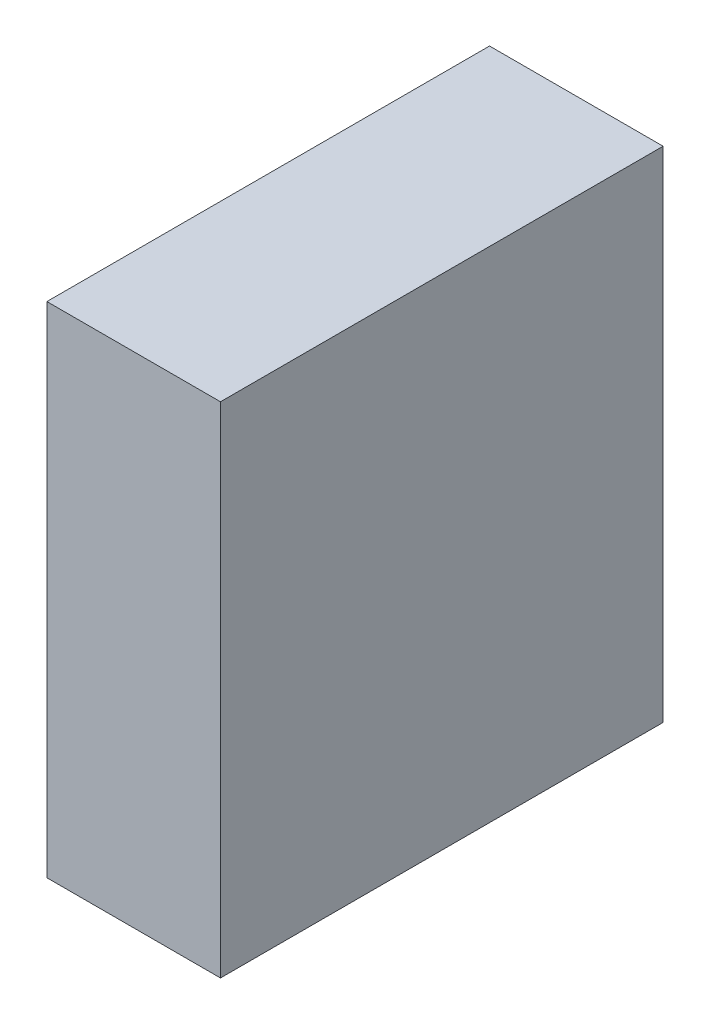
ISO-10303-21;
HEADER;
FILE_DESCRIPTION(('STEP AP214'),'2;1');
FILE_NAME('part.step','',(''),(''),'','','');
FILE_SCHEMA(('AUTOMOTIVE_DESIGN { 1 0 10303 214 1 1 1 1 }'));
ENDSEC;
DATA;
#1=APPLICATION_CONTEXT('core data for automotive mechanical design processes');
#2=APPLICATION_PROTOCOL_DEFINITION('international standard','automotive_design',2000,#1);
#3=PRODUCT_CONTEXT('',#1,'mechanical');
#4=PRODUCT('Part','Part','',(#3));
#5=PRODUCT_RELATED_PRODUCT_CATEGORY('part','',(#4));
#6=PRODUCT_DEFINITION_FORMATION('','',#4);
#7=PRODUCT_DEFINITION_CONTEXT('part definition',#1,'design');
#8=PRODUCT_DEFINITION('design','',#6,#7);
#9=PRODUCT_DEFINITION_SHAPE('','',#8);
#10=(LENGTH_UNIT() NAMED_UNIT(*) SI_UNIT(.MILLI.,.METRE.));
#11=(NAMED_UNIT(*) PLANE_ANGLE_UNIT() SI_UNIT($,.RADIAN.));
#12=(NAMED_UNIT(*) SI_UNIT($,.STERADIAN.) SOLID_ANGLE_UNIT());
#13=UNCERTAINTY_MEASURE_WITH_UNIT(LENGTH_MEASURE(1.E-05),#10,'distance_accuracy_value','');
#14=(GEOMETRIC_REPRESENTATION_CONTEXT(3) GLOBAL_UNCERTAINTY_ASSIGNED_CONTEXT((#13)) GLOBAL_UNIT_ASSIGNED_CONTEXT((#10,
#11,#12)) REPRESENTATION_CONTEXT('',''));
#15=CARTESIAN_POINT('',(0.,0.,0.));
#16=DIRECTION('',(0.,0.,1.));
#17=DIRECTION('',(1.,0.,0.));
#18=AXIS2_PLACEMENT_3D('',#15,#16,#17);
#19=CARTESIAN_POINT('',(0.09999980000001,0.2875026,0.));
#20=DIRECTION('',(1.,0.,0.));
#21=DIRECTION('',(0.,0.,-1.));
#22=AXIS2_PLACEMENT_3D('',#19,#20,#21);
#23=PLANE('',#22);
#24=DIRECTION('',(0.,0.,-1.));
#25=VECTOR('',#24,1.);
#26=CARTESIAN_POINT('',(0.09999980000001,-0.28750006,0.));
#27=LINE('',#26,#25);
#28=CARTESIAN_POINT('',(0.09999980000001,-0.28750006,0.));
#29=VERTEX_POINT('',#28);
#30=CARTESIAN_POINT('',(0.09999980000001,-0.28750006,0.50999898));
#31=VERTEX_POINT('',#30);
#32=EDGE_CURVE('E20',#29,#31,#27,.F.);
#33=ORIENTED_EDGE('',*,*,#32,.F.);
#34=DIRECTION('',(0.,1.,0.));
#35=VECTOR('',#34,1.);
#36=CARTESIAN_POINT('',(0.09999980000001,-0.28750006,0.));
#37=LINE('',#36,#35);
#38=CARTESIAN_POINT('',(0.09999980000001,0.2875026,0.));
#39=VERTEX_POINT('',#38);
#40=EDGE_CURVE('E80',#29,#39,#37,.T.);
#41=ORIENTED_EDGE('',*,*,#40,.T.);
#42=DIRECTION('',(0.,0.,1.));
#43=VECTOR('',#42,1.);
#44=CARTESIAN_POINT('',(0.09999980000001,0.2875026,0.));
#45=LINE('',#44,#43);
#46=CARTESIAN_POINT('',(0.09999980000001,0.2875026,0.50999898));
#47=VERTEX_POINT('',#46);
#48=EDGE_CURVE('E68',#47,#39,#45,.F.);
#49=ORIENTED_EDGE('',*,*,#48,.F.);
#50=DIRECTION('',(0.,1.,0.));
#51=VECTOR('',#50,1.);
#52=CARTESIAN_POINT('',(0.09999980000001,-0.28750006,0.50999898));
#53=LINE('',#52,#51);
#54=EDGE_CURVE('E56',#31,#47,#53,.T.);
#55=ORIENTED_EDGE('',*,*,#54,.F.);
#56=EDGE_LOOP('',(#33,#41,#49,#55));
#57=FACE_BOUND('',#56,.T.);
#58=ADVANCED_FACE('F17',(#57),#23,.T.);
#59=CARTESIAN_POINT('',(0.09999980000001,-0.28750006,0.));
#60=DIRECTION('',(0.,-1.,0.));
#61=DIRECTION('',(0.,0.,-1.));
#62=AXIS2_PLACEMENT_3D('',#59,#60,#61);
#63=PLANE('',#62);
#64=DIRECTION('',(0.,0.,1.));
#65=VECTOR('',#64,1.);
#66=CARTESIAN_POINT('',(-0.09999980000001,-0.28750006,0.));
#67=LINE('',#66,#65);
#68=CARTESIAN_POINT('',(-0.09999980000001,-0.28750006,0.));
#69=VERTEX_POINT('',#68);
#70=CARTESIAN_POINT('',(-0.09999980000001,-0.28750006,0.50999898));
#71=VERTEX_POINT('',#70);
#72=EDGE_CURVE('E83',#69,#71,#67,.T.);
#73=ORIENTED_EDGE('',*,*,#72,.F.);
#74=DIRECTION('',(1.,0.,0.));
#75=VECTOR('',#74,1.);
#76=CARTESIAN_POINT('',(-0.09999980000001,-0.28750006,0.));
#77=LINE('',#76,#75);
#78=EDGE_CURVE('E65',#69,#29,#77,.T.);
#79=ORIENTED_EDGE('',*,*,#78,.T.);
#80=ORIENTED_EDGE('',*,*,#32,.T.);
#81=DIRECTION('',(1.,0.,0.));
#82=VECTOR('',#81,1.);
#83=CARTESIAN_POINT('',(-0.09999980000001,-0.28750006,0.50999898));
#84=LINE('',#83,#82);
#85=EDGE_CURVE('E62',#71,#31,#84,.T.);
#86=ORIENTED_EDGE('',*,*,#85,.F.);
#87=EDGE_LOOP('',(#73,#79,#80,#86));
#88=FACE_BOUND('',#87,.T.);
#89=ADVANCED_FACE('F61',(#88),#63,.T.);
#90=CARTESIAN_POINT('',(-0.09999980000001,-0.28750006,0.50999898));
#91=DIRECTION('',(0.,0.,1.));
#92=DIRECTION('',(1.,0.,0.));
#93=AXIS2_PLACEMENT_3D('',#90,#91,#92);
#94=PLANE('',#93);
#95=DIRECTION('',(1.,0.,0.));
#96=VECTOR('',#95,1.);
#97=CARTESIAN_POINT('',(-0.09999980000001,0.2875026,0.50999898));
#98=LINE('',#97,#96);
#99=CARTESIAN_POINT('',(-0.09999980000001,0.2875026,0.50999898));
#100=VERTEX_POINT('',#99);
#101=EDGE_CURVE('E70',#100,#47,#98,.T.);
#102=ORIENTED_EDGE('',*,*,#101,.F.);
#103=DIRECTION('',(0.,1.,0.));
#104=VECTOR('',#103,1.);
#105=CARTESIAN_POINT('',(-0.09999980000001,-0.28750006,0.50999898));
#106=LINE('',#105,#104);
#107=EDGE_CURVE('E74',#71,#100,#106,.T.);
#108=ORIENTED_EDGE('',*,*,#107,.F.);
#109=ORIENTED_EDGE('',*,*,#85,.T.);
#110=ORIENTED_EDGE('',*,*,#54,.T.);
#111=EDGE_LOOP('',(#102,#108,#109,#110));
#112=FACE_BOUND('',#111,.T.);
#113=ADVANCED_FACE('F72',(#112),#94,.T.);
#114=CARTESIAN_POINT('',(-0.09999980000001,0.2875026,0.));
#115=DIRECTION('',(0.,1.,0.));
#116=DIRECTION('',(0.,0.,1.));
#117=AXIS2_PLACEMENT_3D('',#114,#115,#116);
#118=PLANE('',#117);
#119=ORIENTED_EDGE('',*,*,#48,.T.);
#120=DIRECTION('',(1.,0.,0.));
#121=VECTOR('',#120,1.);
#122=CARTESIAN_POINT('',(-0.09999980000001,0.2875026,0.));
#123=LINE('',#122,#121);
#124=CARTESIAN_POINT('',(-0.09999980000001,0.2875026,0.));
#125=VERTEX_POINT('',#124);
#126=EDGE_CURVE('E35',#39,#125,#123,.F.);
#127=ORIENTED_EDGE('',*,*,#126,.T.);
#128=DIRECTION('',(0.,0.,1.));
#129=VECTOR('',#128,1.);
#130=CARTESIAN_POINT('',(-0.09999980000001,0.2875026,0.));
#131=LINE('',#130,#129);
#132=EDGE_CURVE('E26',#100,#125,#131,.F.);
#133=ORIENTED_EDGE('',*,*,#132,.F.);
#134=ORIENTED_EDGE('',*,*,#101,.T.);
#135=EDGE_LOOP('',(#119,#127,#133,#134));
#136=FACE_BOUND('',#135,.T.);
#137=ADVANCED_FACE('F89',(#136),#118,.T.);
#138=CARTESIAN_POINT('',(-0.09999980000001,-0.28750006,0.));
#139=DIRECTION('',(0.,0.,1.));
#140=DIRECTION('',(1.,0.,0.));
#141=AXIS2_PLACEMENT_3D('',#138,#139,#140);
#142=PLANE('',#141);
#143=ORIENTED_EDGE('',*,*,#126,.F.);
#144=ORIENTED_EDGE('',*,*,#40,.F.);
#145=ORIENTED_EDGE('',*,*,#78,.F.);
#146=DIRECTION('',(0.,1.,0.));
#147=VECTOR('',#146,1.);
#148=CARTESIAN_POINT('',(-0.09999980000001,-0.28750006,0.));
#149=LINE('',#148,#147);
#150=EDGE_CURVE('E11',#125,#69,#149,.F.);
#151=ORIENTED_EDGE('',*,*,#150,.F.);
#152=EDGE_LOOP('',(#143,#144,#145,#151));
#153=FACE_BOUND('',#152,.T.);
#154=ADVANCED_FACE('F91',(#153),#142,.F.);
#155=CARTESIAN_POINT('',(-0.09999980000001,-0.28750006,0.));
#156=DIRECTION('',(-1.,0.,0.));
#157=DIRECTION('',(0.,0.,1.));
#158=AXIS2_PLACEMENT_3D('',#155,#156,#157);
#159=PLANE('',#158);
#160=ORIENTED_EDGE('',*,*,#132,.T.);
#161=ORIENTED_EDGE('',*,*,#150,.T.);
#162=ORIENTED_EDGE('',*,*,#72,.T.);
#163=ORIENTED_EDGE('',*,*,#107,.T.);
#164=EDGE_LOOP('',(#160,#161,#162,#163));
#165=FACE_BOUND('',#164,.T.);
#166=ADVANCED_FACE('F88',(#165),#159,.T.);
#167=CLOSED_SHELL('',(#58,#89,#113,#137,#154,#166));
#168=MANIFOLD_SOLID_BREP('B1',#167);
#169=ADVANCED_BREP_SHAPE_REPRESENTATION('',(#18,#168),#14);
#170=SHAPE_DEFINITION_REPRESENTATION(#9,#169);
ENDSEC;
END-ISO-10303-21;
